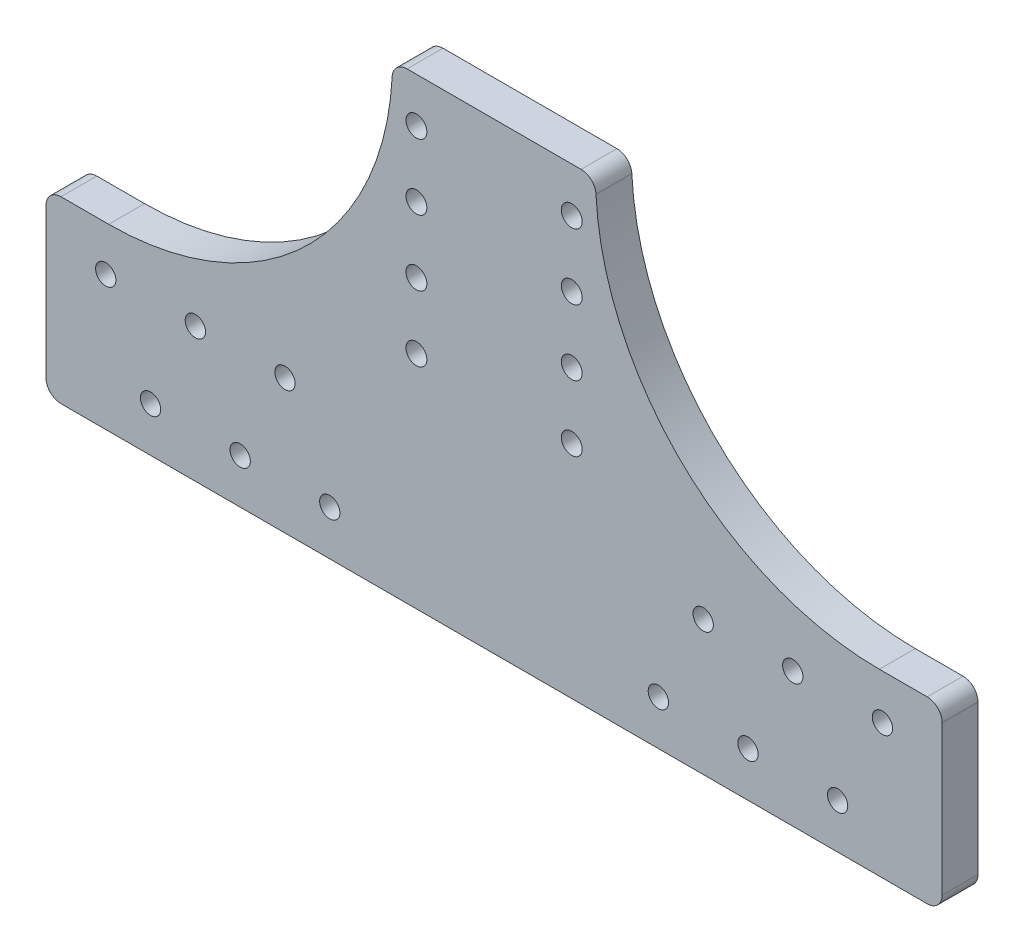
ISO-10303-21;
HEADER;
FILE_DESCRIPTION(('STEP AP214'),'2;1');
FILE_NAME('part.step','',(''),(''),'','','');
FILE_SCHEMA(('AUTOMOTIVE_DESIGN { 1 0 10303 214 1 1 1 1 }'));
ENDSEC;
DATA;
#1=APPLICATION_CONTEXT('core data for automotive mechanical design processes');
#2=APPLICATION_PROTOCOL_DEFINITION('international standard','automotive_design',2000,#1);
#3=PRODUCT_CONTEXT('',#1,'mechanical');
#4=PRODUCT('Part','Part','',(#3));
#5=PRODUCT_RELATED_PRODUCT_CATEGORY('part','',(#4));
#6=PRODUCT_DEFINITION_FORMATION('','',#4);
#7=PRODUCT_DEFINITION_CONTEXT('part definition',#1,'design');
#8=PRODUCT_DEFINITION('design','',#6,#7);
#9=PRODUCT_DEFINITION_SHAPE('','',#8);
#10=(LENGTH_UNIT() NAMED_UNIT(*) SI_UNIT(.MILLI.,.METRE.));
#11=(NAMED_UNIT(*) PLANE_ANGLE_UNIT() SI_UNIT($,.RADIAN.));
#12=(NAMED_UNIT(*) SI_UNIT($,.STERADIAN.) SOLID_ANGLE_UNIT());
#13=UNCERTAINTY_MEASURE_WITH_UNIT(LENGTH_MEASURE(1.E-05),#10,'distance_accuracy_value','');
#14=(GEOMETRIC_REPRESENTATION_CONTEXT(3) GLOBAL_UNCERTAINTY_ASSIGNED_CONTEXT((#13)) GLOBAL_UNIT_ASSIGNED_CONTEXT((#10,
#11,#12)) REPRESENTATION_CONTEXT('',''));
#15=CARTESIAN_POINT('',(0.,0.,0.));
#16=DIRECTION('',(0.,0.,1.));
#17=DIRECTION('',(1.,0.,0.));
#18=AXIS2_PLACEMENT_3D('',#15,#16,#17);
#19=CARTESIAN_POINT('',(26.,44.,6.));
#20=DIRECTION('',(0.,0.,1.));
#21=DIRECTION('',(1.,0.,0.));
#22=AXIS2_PLACEMENT_3D('',#19,#20,#21);
#23=CYLINDRICAL_SURFACE('',#22,3.5);
#24=CARTESIAN_POINT('',(26.,44.,-6.));
#25=DIRECTION('',(0.,0.,1.));
#26=DIRECTION('',(1.,0.,0.));
#27=AXIS2_PLACEMENT_3D('',#24,#25,#26);
#28=CIRCLE('',#27,3.5);
#29=CARTESIAN_POINT('',(29.5,44.,-6.));
#30=VERTEX_POINT('',#29);
#31=EDGE_CURVE('E210',#30,#30,#28,.T.);
#32=ORIENTED_EDGE('',*,*,#31,.F.);
#33=EDGE_LOOP('',(#32));
#34=FACE_BOUND('',#33,.T.);
#35=CARTESIAN_POINT('',(26.,44.,6.));
#36=DIRECTION('',(0.,0.,1.));
#37=DIRECTION('',(1.,0.,0.));
#38=AXIS2_PLACEMENT_3D('',#35,#36,#37);
#39=CIRCLE('',#38,3.5);
#40=CARTESIAN_POINT('',(29.5,44.,6.));
#41=VERTEX_POINT('',#40);
#42=EDGE_CURVE('E213',#41,#41,#39,.T.);
#43=ORIENTED_EDGE('',*,*,#42,.T.);
#44=EDGE_LOOP('',(#43));
#45=FACE_BOUND('',#44,.T.);
#46=ADVANCED_FACE('F33',(#34,#45),#23,.F.);
#47=CARTESIAN_POINT('',(26.,66.,6.));
#48=DIRECTION('',(0.,0.,1.));
#49=DIRECTION('',(1.,0.,0.));
#50=AXIS2_PLACEMENT_3D('',#47,#48,#49);
#51=CYLINDRICAL_SURFACE('',#50,3.5);
#52=CARTESIAN_POINT('',(26.,66.,-6.));
#53=DIRECTION('',(0.,0.,1.));
#54=DIRECTION('',(1.,0.,0.));
#55=AXIS2_PLACEMENT_3D('',#52,#53,#54);
#56=CIRCLE('',#55,3.5);
#57=CARTESIAN_POINT('',(29.5,66.,-6.));
#58=VERTEX_POINT('',#57);
#59=EDGE_CURVE('E204',#58,#58,#56,.T.);
#60=ORIENTED_EDGE('',*,*,#59,.F.);
#61=EDGE_LOOP('',(#60));
#62=FACE_BOUND('',#61,.T.);
#63=CARTESIAN_POINT('',(26.,66.,6.));
#64=DIRECTION('',(0.,0.,1.));
#65=DIRECTION('',(1.,0.,0.));
#66=AXIS2_PLACEMENT_3D('',#63,#64,#65);
#67=CIRCLE('',#66,3.5);
#68=CARTESIAN_POINT('',(29.5,66.,6.));
#69=VERTEX_POINT('',#68);
#70=EDGE_CURVE('E207',#69,#69,#67,.T.);
#71=ORIENTED_EDGE('',*,*,#70,.T.);
#72=EDGE_LOOP('',(#71));
#73=FACE_BOUND('',#72,.T.);
#74=ADVANCED_FACE('F325',(#62,#73),#51,.F.);
#75=CARTESIAN_POINT('',(150.,30.,6.));
#76=DIRECTION('',(-1.,0.,0.));
#77=DIRECTION('',(0.,0.,1.));
#78=AXIS2_PLACEMENT_3D('',#75,#76,#77);
#79=PLANE('',#78);
#80=DIRECTION('',(0.,1.,0.));
#81=VECTOR('',#80,1.);
#82=CARTESIAN_POINT('',(150.,30.,6.));
#83=LINE('',#82,#81);
#84=CARTESIAN_POINT('',(150.,-25.,6.));
#85=VERTEX_POINT('',#84);
#86=CARTESIAN_POINT('',(150.,25.,6.));
#87=VERTEX_POINT('',#86);
#88=EDGE_CURVE('E184',#85,#87,#83,.T.);
#89=ORIENTED_EDGE('',*,*,#88,.F.);
#90=DIRECTION('',(0.,0.,-1.));
#91=VECTOR('',#90,1.);
#92=CARTESIAN_POINT('',(150.,-25.,-6.));
#93=LINE('',#92,#91);
#94=CARTESIAN_POINT('',(150.,-25.,-6.));
#95=VERTEX_POINT('',#94);
#96=EDGE_CURVE('E236',#85,#95,#93,.T.);
#97=ORIENTED_EDGE('',*,*,#96,.T.);
#98=DIRECTION('',(0.,1.,0.));
#99=VECTOR('',#98,1.);
#100=CARTESIAN_POINT('',(150.,30.,-6.));
#101=LINE('',#100,#99);
#102=CARTESIAN_POINT('',(150.,25.,-6.));
#103=VERTEX_POINT('',#102);
#104=EDGE_CURVE('E183',#95,#103,#101,.T.);
#105=ORIENTED_EDGE('',*,*,#104,.T.);
#106=DIRECTION('',(0.,0.,-1.));
#107=VECTOR('',#106,1.);
#108=CARTESIAN_POINT('',(150.,25.,6.));
#109=LINE('',#108,#107);
#110=EDGE_CURVE('E224',#103,#87,#109,.F.);
#111=ORIENTED_EDGE('',*,*,#110,.T.);
#112=EDGE_LOOP('',(#89,#97,#105,#111));
#113=FACE_BOUND('',#112,.T.);
#114=ADVANCED_FACE('F292',(#113),#79,.F.);
#115=CARTESIAN_POINT('',(129.,30.,6.));
#116=DIRECTION('',(0.,-1.,0.));
#117=DIRECTION('',(0.,0.,-1.));
#118=AXIS2_PLACEMENT_3D('',#115,#116,#117);
#119=PLANE('',#118);
#120=DIRECTION('',(-1.,0.,0.));
#121=VECTOR('',#120,1.);
#122=CARTESIAN_POINT('',(129.,30.,6.));
#123=LINE('',#122,#121);
#124=CARTESIAN_POINT('',(145.,30.,6.));
#125=VERTEX_POINT('',#124);
#126=CARTESIAN_POINT('',(129.,30.,6.));
#127=VERTEX_POINT('',#126);
#128=EDGE_CURVE('E186',#125,#127,#123,.T.);
#129=ORIENTED_EDGE('',*,*,#128,.F.);
#130=DIRECTION('',(0.,0.,-1.));
#131=VECTOR('',#130,1.);
#132=CARTESIAN_POINT('',(145.,30.,6.));
#133=LINE('',#132,#131);
#134=CARTESIAN_POINT('',(145.,30.,-6.));
#135=VERTEX_POINT('',#134);
#136=EDGE_CURVE('E216',#125,#135,#133,.T.);
#137=ORIENTED_EDGE('',*,*,#136,.T.);
#138=DIRECTION('',(-1.,0.,0.));
#139=VECTOR('',#138,1.);
#140=CARTESIAN_POINT('',(129.,30.,-6.));
#141=LINE('',#140,#139);
#142=CARTESIAN_POINT('',(129.,30.,-6.));
#143=VERTEX_POINT('',#142);
#144=EDGE_CURVE('E196',#135,#143,#141,.T.);
#145=ORIENTED_EDGE('',*,*,#144,.T.);
#146=DIRECTION('',(0.,0.,-1.));
#147=VECTOR('',#146,1.);
#148=CARTESIAN_POINT('',(129.,30.,6.));
#149=LINE('',#148,#147);
#150=EDGE_CURVE('E194',#127,#143,#149,.T.);
#151=ORIENTED_EDGE('',*,*,#150,.F.);
#152=EDGE_LOOP('',(#129,#137,#145,#151));
#153=FACE_BOUND('',#152,.T.);
#154=ADVANCED_FACE('F304',(#153),#119,.F.);
#155=CARTESIAN_POINT('',(129.,125.,6.));
#156=DIRECTION('',(0.,0.,-1.));
#157=DIRECTION('',(-1.,0.,0.));
#158=AXIS2_PLACEMENT_3D('',#155,#156,#157);
#159=CYLINDRICAL_SURFACE('',#158,95.);
#160=CARTESIAN_POINT('',(129.,125.,-6.));
#161=DIRECTION('',(0.,0.,-1.));
#162=DIRECTION('',(1.,0.,0.));
#163=AXIS2_PLACEMENT_3D('',#160,#161,#162);
#164=CIRCLE('',#163,95.);
#165=CARTESIAN_POINT('',(34.1188243116686,120.25,-6.));
#166=VERTEX_POINT('',#165);
#167=EDGE_CURVE('E198',#143,#166,#164,.T.);
#168=ORIENTED_EDGE('',*,*,#167,.T.);
#169=DIRECTION('',(0.,0.,-1.));
#170=VECTOR('',#169,1.);
#171=CARTESIAN_POINT('',(34.1188243116686,120.25,6.));
#172=LINE('',#171,#170);
#173=CARTESIAN_POINT('',(34.1188243116686,120.25,6.));
#174=VERTEX_POINT('',#173);
#175=EDGE_CURVE('E234',#166,#174,#172,.F.);
#176=ORIENTED_EDGE('',*,*,#175,.T.);
#177=CARTESIAN_POINT('',(129.,125.,6.));
#178=DIRECTION('',(0.,0.,-1.));
#179=DIRECTION('',(1.,0.,0.));
#180=AXIS2_PLACEMENT_3D('',#177,#178,#179);
#181=CIRCLE('',#180,95.);
#182=EDGE_CURVE('E189',#127,#174,#181,.T.);
#183=ORIENTED_EDGE('',*,*,#182,.F.);
#184=ORIENTED_EDGE('',*,*,#150,.T.);
#185=EDGE_LOOP('',(#168,#176,#183,#184));
#186=FACE_BOUND('',#185,.T.);
#187=ADVANCED_FACE('F307',(#186),#159,.F.);
#188=CARTESIAN_POINT('',(0.,125.,6.));
#189=DIRECTION('',(0.,-1.,0.));
#190=DIRECTION('',(1.,0.,0.));
#191=AXIS2_PLACEMENT_3D('',#188,#189,#190);
#192=PLANE('',#191);
#193=DIRECTION('',(-1.,0.,0.));
#194=VECTOR('',#193,1.);
#195=CARTESIAN_POINT('',(0.,125.,-6.));
#196=LINE('',#195,#194);
#197=CARTESIAN_POINT('',(29.1250782228091,125.,-6.));
#198=VERTEX_POINT('',#197);
#199=CARTESIAN_POINT('',(-29.1250782228091,125.,-6.));
#200=VERTEX_POINT('',#199);
#201=EDGE_CURVE('E187',#198,#200,#196,.T.);
#202=ORIENTED_EDGE('',*,*,#201,.T.);
#203=DIRECTION('',(0.,0.,1.));
#204=VECTOR('',#203,1.);
#205=CARTESIAN_POINT('',(-29.1250782228091,125.,6.));
#206=LINE('',#205,#204);
#207=CARTESIAN_POINT('',(-29.1250782228091,125.,6.));
#208=VERTEX_POINT('',#207);
#209=EDGE_CURVE('E11',#200,#208,#206,.T.);
#210=ORIENTED_EDGE('',*,*,#209,.T.);
#211=DIRECTION('',(-1.,0.,0.));
#212=VECTOR('',#211,1.);
#213=CARTESIAN_POINT('',(0.,125.,6.));
#214=LINE('',#213,#212);
#215=CARTESIAN_POINT('',(29.1250782228091,125.,6.));
#216=VERTEX_POINT('',#215);
#217=EDGE_CURVE('E192',#216,#208,#214,.T.);
#218=ORIENTED_EDGE('',*,*,#217,.F.);
#219=DIRECTION('',(0.,0.,-1.));
#220=VECTOR('',#219,1.);
#221=CARTESIAN_POINT('',(29.1250782228091,125.,6.));
#222=LINE('',#221,#220);
#223=EDGE_CURVE('E231',#216,#198,#222,.T.);
#224=ORIENTED_EDGE('',*,*,#223,.T.);
#225=EDGE_LOOP('',(#202,#210,#218,#224));
#226=FACE_BOUND('',#225,.T.);
#227=ADVANCED_FACE('F313',(#226),#192,.F.);
#228=CARTESIAN_POINT('',(129.,125.,6.));
#229=DIRECTION('',(0.,0.,1.));
#230=DIRECTION('',(1.,0.,0.));
#231=AXIS2_PLACEMENT_3D('',#228,#229,#230);
#232=PLANE('',#231);
#233=CARTESIAN_POINT('',(-145.,-25.,6.));
#234=DIRECTION('',(0.,0.,1.));
#235=DIRECTION('',(1.,0.,0.));
#236=AXIS2_PLACEMENT_3D('',#233,#234,#235);
#237=CIRCLE('',#236,5.);
#238=CARTESIAN_POINT('',(-150.,-25.,6.));
#239=VERTEX_POINT('',#238);
#240=CARTESIAN_POINT('',(-145.,-30.,6.));
#241=VERTEX_POINT('',#240);
#242=EDGE_CURVE('E252',#239,#241,#237,.T.);
#243=ORIENTED_EDGE('',*,*,#242,.T.);
#244=DIRECTION('',(-1.,0.,0.));
#245=VECTOR('',#244,1.);
#246=CARTESIAN_POINT('',(129.,-30.,6.));
#247=LINE('',#246,#245);
#248=CARTESIAN_POINT('',(145.,-30.,6.));
#249=VERTEX_POINT('',#248);
#250=EDGE_CURVE('E170',#249,#241,#247,.T.);
#251=ORIENTED_EDGE('',*,*,#250,.F.);
#252=CARTESIAN_POINT('',(145.,-25.,6.));
#253=DIRECTION('',(0.,0.,1.));
#254=DIRECTION('',(1.,0.,0.));
#255=AXIS2_PLACEMENT_3D('',#252,#253,#254);
#256=CIRCLE('',#255,5.);
#257=EDGE_CURVE('E243',#249,#85,#256,.T.);
#258=ORIENTED_EDGE('',*,*,#257,.T.);
#259=ORIENTED_EDGE('',*,*,#88,.T.);
#260=CARTESIAN_POINT('',(145.,25.,6.));
#261=DIRECTION('',(0.,0.,1.));
#262=DIRECTION('',(1.,0.,0.));
#263=AXIS2_PLACEMENT_3D('',#260,#261,#262);
#264=CIRCLE('',#263,5.);
#265=EDGE_CURVE('E229',#87,#125,#264,.T.);
#266=ORIENTED_EDGE('',*,*,#265,.T.);
#267=ORIENTED_EDGE('',*,*,#128,.T.);
#268=ORIENTED_EDGE('',*,*,#182,.T.);
#269=CARTESIAN_POINT('',(29.1250782228091,120.,6.));
#270=DIRECTION('',(0.,0.,1.));
#271=DIRECTION('',(1.,0.,0.));
#272=AXIS2_PLACEMENT_3D('',#269,#270,#271);
#273=CIRCLE('',#272,5.);
#274=EDGE_CURVE('E227',#174,#216,#273,.T.);
#275=ORIENTED_EDGE('',*,*,#274,.T.);
#276=ORIENTED_EDGE('',*,*,#217,.T.);
#277=CARTESIAN_POINT('',(-29.1250782228091,120.,6.));
#278=DIRECTION('',(0.,0.,1.));
#279=DIRECTION('',(1.,0.,0.));
#280=AXIS2_PLACEMENT_3D('',#277,#278,#279);
#281=CIRCLE('',#280,5.);
#282=CARTESIAN_POINT('',(-34.1188243116686,120.25,6.));
#283=VERTEX_POINT('',#282);
#284=EDGE_CURVE('E48',#208,#283,#281,.T.);
#285=ORIENTED_EDGE('',*,*,#284,.T.);
#286=CARTESIAN_POINT('',(-129.,125.,6.));
#287=DIRECTION('',(0.,0.,1.));
#288=DIRECTION('',(-1.,0.,0.));
#289=AXIS2_PLACEMENT_3D('',#286,#287,#288);
#290=CIRCLE('',#289,95.);
#291=CARTESIAN_POINT('',(-129.,30.,6.));
#292=VERTEX_POINT('',#291);
#293=EDGE_CURVE('E145',#292,#283,#290,.T.);
#294=ORIENTED_EDGE('',*,*,#293,.F.);
#295=DIRECTION('',(1.,0.,0.));
#296=VECTOR('',#295,1.);
#297=CARTESIAN_POINT('',(-129.,30.,6.));
#298=LINE('',#297,#296);
#299=CARTESIAN_POINT('',(-145.,30.,6.));
#300=VERTEX_POINT('',#299);
#301=EDGE_CURVE('E135',#300,#292,#298,.T.);
#302=ORIENTED_EDGE('',*,*,#301,.F.);
#303=CARTESIAN_POINT('',(-145.,25.,6.));
#304=DIRECTION('',(0.,0.,1.));
#305=DIRECTION('',(1.,0.,0.));
#306=AXIS2_PLACEMENT_3D('',#303,#304,#305);
#307=CIRCLE('',#306,5.);
#308=CARTESIAN_POINT('',(-150.,25.,6.));
#309=VERTEX_POINT('',#308);
#310=EDGE_CURVE('E263',#300,#309,#307,.T.);
#311=ORIENTED_EDGE('',*,*,#310,.T.);
#312=DIRECTION('',(0.,1.,0.));
#313=VECTOR('',#312,1.);
#314=CARTESIAN_POINT('',(-150.,30.,6.));
#315=LINE('',#314,#313);
#316=EDGE_CURVE('E144',#239,#309,#315,.T.);
#317=ORIENTED_EDGE('',*,*,#316,.F.);
#318=EDGE_LOOP('',(#243,#251,#258,#259,#266,#267,#268,#275,#276,#285,#294,#302,#311,#317));
#319=FACE_BOUND('',#318,.T.);
#320=CARTESIAN_POINT('',(-130.,15.,6.));
#321=DIRECTION('',(0.,0.,1.));
#322=DIRECTION('',(1.,0.,0.));
#323=AXIS2_PLACEMENT_3D('',#320,#321,#322);
#324=CIRCLE('',#323,3.39999999999999);
#325=CARTESIAN_POINT('',(-126.6,15.,6.));
#326=VERTEX_POINT('',#325);
#327=EDGE_CURVE('E698',#326,#326,#324,.T.);
#328=ORIENTED_EDGE('',*,*,#327,.F.);
#329=EDGE_LOOP('',(#328));
#330=FACE_BOUND('',#329,.T.);
#331=CARTESIAN_POINT('',(-100.,15.,6.));
#332=DIRECTION('',(0.,0.,1.));
#333=DIRECTION('',(1.,0.,0.));
#334=AXIS2_PLACEMENT_3D('',#331,#332,#333);
#335=CIRCLE('',#334,3.4);
#336=CARTESIAN_POINT('',(-96.6,15.,6.));
#337=VERTEX_POINT('',#336);
#338=EDGE_CURVE('E700',#337,#337,#335,.T.);
#339=ORIENTED_EDGE('',*,*,#338,.F.);
#340=EDGE_LOOP('',(#339));
#341=FACE_BOUND('',#340,.T.);
#342=CARTESIAN_POINT('',(-70.,15.,6.));
#343=DIRECTION('',(0.,0.,1.));
#344=DIRECTION('',(1.,0.,0.));
#345=AXIS2_PLACEMENT_3D('',#342,#343,#344);
#346=CIRCLE('',#345,3.4);
#347=CARTESIAN_POINT('',(-66.6,15.,6.));
#348=VERTEX_POINT('',#347);
#349=EDGE_CURVE('E708',#348,#348,#346,.T.);
#350=ORIENTED_EDGE('',*,*,#349,.F.);
#351=EDGE_LOOP('',(#350));
#352=FACE_BOUND('',#351,.T.);
#353=CARTESIAN_POINT('',(-115.,-15.,6.));
#354=DIRECTION('',(0.,0.,1.));
#355=DIRECTION('',(1.,0.,0.));
#356=AXIS2_PLACEMENT_3D('',#353,#354,#355);
#357=CIRCLE('',#356,3.4);
#358=CARTESIAN_POINT('',(-111.6,-15.,6.));
#359=VERTEX_POINT('',#358);
#360=EDGE_CURVE('E714',#359,#359,#357,.T.);
#361=ORIENTED_EDGE('',*,*,#360,.F.);
#362=EDGE_LOOP('',(#361));
#363=FACE_BOUND('',#362,.T.);
#364=CARTESIAN_POINT('',(-85.,-15.,6.));
#365=DIRECTION('',(0.,0.,1.));
#366=DIRECTION('',(1.,0.,0.));
#367=AXIS2_PLACEMENT_3D('',#364,#365,#366);
#368=CIRCLE('',#367,3.4);
#369=CARTESIAN_POINT('',(-81.6,-15.,6.));
#370=VERTEX_POINT('',#369);
#371=EDGE_CURVE('E720',#370,#370,#368,.T.);
#372=ORIENTED_EDGE('',*,*,#371,.F.);
#373=EDGE_LOOP('',(#372));
#374=FACE_BOUND('',#373,.T.);
#375=CARTESIAN_POINT('',(-55.,-15.,6.));
#376=DIRECTION('',(0.,0.,1.));
#377=DIRECTION('',(1.,0.,0.));
#378=AXIS2_PLACEMENT_3D('',#375,#376,#377);
#379=CIRCLE('',#378,3.4);
#380=CARTESIAN_POINT('',(-51.6,-15.,6.));
#381=VERTEX_POINT('',#380);
#382=EDGE_CURVE('E726',#381,#381,#379,.T.);
#383=ORIENTED_EDGE('',*,*,#382,.F.);
#384=EDGE_LOOP('',(#383));
#385=FACE_BOUND('',#384,.T.);
#386=CARTESIAN_POINT('',(130.,15.,6.));
#387=DIRECTION('',(0.,0.,1.));
#388=DIRECTION('',(1.,0.,0.));
#389=AXIS2_PLACEMENT_3D('',#386,#387,#388);
#390=CIRCLE('',#389,3.39999999999999);
#391=CARTESIAN_POINT('',(133.4,15.,6.));
#392=VERTEX_POINT('',#391);
#393=EDGE_CURVE('E732',#392,#392,#390,.T.);
#394=ORIENTED_EDGE('',*,*,#393,.F.);
#395=EDGE_LOOP('',(#394));
#396=FACE_BOUND('',#395,.T.);
#397=CARTESIAN_POINT('',(100.,15.,6.));
#398=DIRECTION('',(0.,0.,1.));
#399=DIRECTION('',(1.,0.,0.));
#400=AXIS2_PLACEMENT_3D('',#397,#398,#399);
#401=CIRCLE('',#400,3.4);
#402=CARTESIAN_POINT('',(103.4,15.,6.));
#403=VERTEX_POINT('',#402);
#404=EDGE_CURVE('E738',#403,#403,#401,.T.);
#405=ORIENTED_EDGE('',*,*,#404,.F.);
#406=EDGE_LOOP('',(#405));
#407=FACE_BOUND('',#406,.T.);
#408=CARTESIAN_POINT('',(70.,15.,6.));
#409=DIRECTION('',(0.,0.,1.));
#410=DIRECTION('',(1.,0.,0.));
#411=AXIS2_PLACEMENT_3D('',#408,#409,#410);
#412=CIRCLE('',#411,3.4);
#413=CARTESIAN_POINT('',(73.4,15.,6.));
#414=VERTEX_POINT('',#413);
#415=EDGE_CURVE('E744',#414,#414,#412,.T.);
#416=ORIENTED_EDGE('',*,*,#415,.F.);
#417=EDGE_LOOP('',(#416));
#418=FACE_BOUND('',#417,.T.);
#419=CARTESIAN_POINT('',(115.,-15.,6.));
#420=DIRECTION('',(0.,0.,1.));
#421=DIRECTION('',(1.,0.,0.));
#422=AXIS2_PLACEMENT_3D('',#419,#420,#421);
#423=CIRCLE('',#422,3.4);
#424=CARTESIAN_POINT('',(118.4,-15.,6.));
#425=VERTEX_POINT('',#424);
#426=EDGE_CURVE('E750',#425,#425,#423,.T.);
#427=ORIENTED_EDGE('',*,*,#426,.F.);
#428=EDGE_LOOP('',(#427));
#429=FACE_BOUND('',#428,.T.);
#430=CARTESIAN_POINT('',(85.,-15.,6.));
#431=DIRECTION('',(0.,0.,1.));
#432=DIRECTION('',(1.,0.,0.));
#433=AXIS2_PLACEMENT_3D('',#430,#431,#432);
#434=CIRCLE('',#433,3.4);
#435=CARTESIAN_POINT('',(88.4,-15.,6.));
#436=VERTEX_POINT('',#435);
#437=EDGE_CURVE('E756',#436,#436,#434,.T.);
#438=ORIENTED_EDGE('',*,*,#437,.F.);
#439=EDGE_LOOP('',(#438));
#440=FACE_BOUND('',#439,.T.);
#441=CARTESIAN_POINT('',(55.,-15.,6.));
#442=DIRECTION('',(0.,0.,1.));
#443=DIRECTION('',(1.,0.,0.));
#444=AXIS2_PLACEMENT_3D('',#441,#442,#443);
#445=CIRCLE('',#444,3.4);
#446=CARTESIAN_POINT('',(58.4,-15.,6.));
#447=VERTEX_POINT('',#446);
#448=EDGE_CURVE('E762',#447,#447,#445,.T.);
#449=ORIENTED_EDGE('',*,*,#448,.F.);
#450=EDGE_LOOP('',(#449));
#451=FACE_BOUND('',#450,.T.);
#452=CARTESIAN_POINT('',(-26.,44.,6.));
#453=DIRECTION('',(0.,0.,1.));
#454=DIRECTION('',(1.,0.,0.));
#455=AXIS2_PLACEMENT_3D('',#452,#453,#454);
#456=CIRCLE('',#455,3.5);
#457=CARTESIAN_POINT('',(-22.5,44.,6.));
#458=VERTEX_POINT('',#457);
#459=EDGE_CURVE('E768',#458,#458,#456,.T.);
#460=ORIENTED_EDGE('',*,*,#459,.F.);
#461=EDGE_LOOP('',(#460));
#462=FACE_BOUND('',#461,.T.);
#463=CARTESIAN_POINT('',(-26.,66.,6.));
#464=DIRECTION('',(0.,0.,1.));
#465=DIRECTION('',(1.,0.,0.));
#466=AXIS2_PLACEMENT_3D('',#463,#464,#465);
#467=CIRCLE('',#466,3.5);
#468=CARTESIAN_POINT('',(-22.5,66.,6.));
#469=VERTEX_POINT('',#468);
#470=EDGE_CURVE('E774',#469,#469,#467,.T.);
#471=ORIENTED_EDGE('',*,*,#470,.F.);
#472=EDGE_LOOP('',(#471));
#473=FACE_BOUND('',#472,.T.);
#474=CARTESIAN_POINT('',(-26.,88.,6.));
#475=DIRECTION('',(0.,0.,1.));
#476=DIRECTION('',(1.,0.,0.));
#477=AXIS2_PLACEMENT_3D('',#474,#475,#476);
#478=CIRCLE('',#477,3.5);
#479=CARTESIAN_POINT('',(-22.5,88.,6.));
#480=VERTEX_POINT('',#479);
#481=EDGE_CURVE('E780',#480,#480,#478,.T.);
#482=ORIENTED_EDGE('',*,*,#481,.F.);
#483=EDGE_LOOP('',(#482));
#484=FACE_BOUND('',#483,.T.);
#485=CARTESIAN_POINT('',(-26.,110.,6.));
#486=DIRECTION('',(0.,0.,1.));
#487=DIRECTION('',(1.,0.,0.));
#488=AXIS2_PLACEMENT_3D('',#485,#486,#487);
#489=CIRCLE('',#488,3.5);
#490=CARTESIAN_POINT('',(-22.5,110.,6.));
#491=VERTEX_POINT('',#490);
#492=EDGE_CURVE('E786',#491,#491,#489,.T.);
#493=ORIENTED_EDGE('',*,*,#492,.F.);
#494=EDGE_LOOP('',(#493));
#495=FACE_BOUND('',#494,.T.);
#496=CARTESIAN_POINT('',(26.,88.,6.));
#497=DIRECTION('',(0.,0.,1.));
#498=DIRECTION('',(1.,0.,0.));
#499=AXIS2_PLACEMENT_3D('',#496,#497,#498);
#500=CIRCLE('',#499,3.5);
#501=CARTESIAN_POINT('',(29.5,88.,6.));
#502=VERTEX_POINT('',#501);
#503=EDGE_CURVE('E174',#502,#502,#500,.T.);
#504=ORIENTED_EDGE('',*,*,#503,.F.);
#505=EDGE_LOOP('',(#504));
#506=FACE_BOUND('',#505,.T.);
#507=CARTESIAN_POINT('',(26.,110.,6.));
#508=DIRECTION('',(0.,0.,1.));
#509=DIRECTION('',(1.,0.,0.));
#510=AXIS2_PLACEMENT_3D('',#507,#508,#509);
#511=CIRCLE('',#510,3.5);
#512=CARTESIAN_POINT('',(29.5,110.,6.));
#513=VERTEX_POINT('',#512);
#514=EDGE_CURVE('E177',#513,#513,#511,.T.);
#515=ORIENTED_EDGE('',*,*,#514,.F.);
#516=EDGE_LOOP('',(#515));
#517=FACE_BOUND('',#516,.T.);
#518=ORIENTED_EDGE('',*,*,#70,.F.);
#519=EDGE_LOOP('',(#518));
#520=FACE_BOUND('',#519,.T.);
#521=ORIENTED_EDGE('',*,*,#42,.F.);
#522=EDGE_LOOP('',(#521));
#523=FACE_BOUND('',#522,.T.);
#524=ADVANCED_FACE('F156',(#319,#330,#341,#352,#363,#374,#385,#396,#407,#418,#429,#440,#451,
#462,#473,#484,#495,#506,#517,#520,#523),#232,.T.);
#525=CARTESIAN_POINT('',(129.,125.,-6.));
#526=DIRECTION('',(0.,0.,1.));
#527=DIRECTION('',(1.,0.,0.));
#528=AXIS2_PLACEMENT_3D('',#525,#526,#527);
#529=PLANE('',#528);
#530=CARTESIAN_POINT('',(-130.,15.,-6.));
#531=DIRECTION('',(0.,0.,1.));
#532=DIRECTION('',(1.,0.,0.));
#533=AXIS2_PLACEMENT_3D('',#530,#531,#532);
#534=CIRCLE('',#533,3.39999999999999);
#535=CARTESIAN_POINT('',(-126.6,15.,-6.));
#536=VERTEX_POINT('',#535);
#537=EDGE_CURVE('E695',#536,#536,#534,.T.);
#538=ORIENTED_EDGE('',*,*,#537,.T.);
#539=EDGE_LOOP('',(#538));
#540=FACE_BOUND('',#539,.T.);
#541=CARTESIAN_POINT('',(-100.,15.,-6.));
#542=DIRECTION('',(0.,0.,1.));
#543=DIRECTION('',(1.,0.,0.));
#544=AXIS2_PLACEMENT_3D('',#541,#542,#543);
#545=CIRCLE('',#544,3.4);
#546=CARTESIAN_POINT('',(-96.6,15.,-6.));
#547=VERTEX_POINT('',#546);
#548=EDGE_CURVE('E705',#547,#547,#545,.T.);
#549=ORIENTED_EDGE('',*,*,#548,.T.);
#550=EDGE_LOOP('',(#549));
#551=FACE_BOUND('',#550,.T.);
#552=CARTESIAN_POINT('',(-70.,15.,-6.));
#553=DIRECTION('',(0.,0.,1.));
#554=DIRECTION('',(1.,0.,0.));
#555=AXIS2_PLACEMENT_3D('',#552,#553,#554);
#556=CIRCLE('',#555,3.4);
#557=CARTESIAN_POINT('',(-66.6,15.,-6.));
#558=VERTEX_POINT('',#557);
#559=EDGE_CURVE('E711',#558,#558,#556,.T.);
#560=ORIENTED_EDGE('',*,*,#559,.T.);
#561=EDGE_LOOP('',(#560));
#562=FACE_BOUND('',#561,.T.);
#563=CARTESIAN_POINT('',(-115.,-15.,-6.));
#564=DIRECTION('',(0.,0.,1.));
#565=DIRECTION('',(1.,0.,0.));
#566=AXIS2_PLACEMENT_3D('',#563,#564,#565);
#567=CIRCLE('',#566,3.4);
#568=CARTESIAN_POINT('',(-111.6,-15.,-6.));
#569=VERTEX_POINT('',#568);
#570=EDGE_CURVE('E717',#569,#569,#567,.T.);
#571=ORIENTED_EDGE('',*,*,#570,.T.);
#572=EDGE_LOOP('',(#571));
#573=FACE_BOUND('',#572,.T.);
#574=CARTESIAN_POINT('',(-85.,-15.,-6.));
#575=DIRECTION('',(0.,0.,1.));
#576=DIRECTION('',(1.,0.,0.));
#577=AXIS2_PLACEMENT_3D('',#574,#575,#576);
#578=CIRCLE('',#577,3.4);
#579=CARTESIAN_POINT('',(-81.6,-15.,-6.));
#580=VERTEX_POINT('',#579);
#581=EDGE_CURVE('E723',#580,#580,#578,.T.);
#582=ORIENTED_EDGE('',*,*,#581,.T.);
#583=EDGE_LOOP('',(#582));
#584=FACE_BOUND('',#583,.T.);
#585=CARTESIAN_POINT('',(-55.,-15.,-6.));
#586=DIRECTION('',(0.,0.,1.));
#587=DIRECTION('',(1.,0.,0.));
#588=AXIS2_PLACEMENT_3D('',#585,#586,#587);
#589=CIRCLE('',#588,3.4);
#590=CARTESIAN_POINT('',(-51.6,-15.,-6.));
#591=VERTEX_POINT('',#590);
#592=EDGE_CURVE('E729',#591,#591,#589,.T.);
#593=ORIENTED_EDGE('',*,*,#592,.T.);
#594=EDGE_LOOP('',(#593));
#595=FACE_BOUND('',#594,.T.);
#596=CARTESIAN_POINT('',(130.,15.,-6.));
#597=DIRECTION('',(0.,0.,1.));
#598=DIRECTION('',(1.,0.,0.));
#599=AXIS2_PLACEMENT_3D('',#596,#597,#598);
#600=CIRCLE('',#599,3.39999999999999);
#601=CARTESIAN_POINT('',(133.4,15.,-6.));
#602=VERTEX_POINT('',#601);
#603=EDGE_CURVE('E735',#602,#602,#600,.T.);
#604=ORIENTED_EDGE('',*,*,#603,.T.);
#605=EDGE_LOOP('',(#604));
#606=FACE_BOUND('',#605,.T.);
#607=CARTESIAN_POINT('',(100.,15.,-6.));
#608=DIRECTION('',(0.,0.,1.));
#609=DIRECTION('',(1.,0.,0.));
#610=AXIS2_PLACEMENT_3D('',#607,#608,#609);
#611=CIRCLE('',#610,3.4);
#612=CARTESIAN_POINT('',(103.4,15.,-6.));
#613=VERTEX_POINT('',#612);
#614=EDGE_CURVE('E741',#613,#613,#611,.T.);
#615=ORIENTED_EDGE('',*,*,#614,.T.);
#616=EDGE_LOOP('',(#615));
#617=FACE_BOUND('',#616,.T.);
#618=CARTESIAN_POINT('',(70.,15.,-6.));
#619=DIRECTION('',(0.,0.,1.));
#620=DIRECTION('',(1.,0.,0.));
#621=AXIS2_PLACEMENT_3D('',#618,#619,#620);
#622=CIRCLE('',#621,3.4);
#623=CARTESIAN_POINT('',(73.4,15.,-6.));
#624=VERTEX_POINT('',#623);
#625=EDGE_CURVE('E747',#624,#624,#622,.T.);
#626=ORIENTED_EDGE('',*,*,#625,.T.);
#627=EDGE_LOOP('',(#626));
#628=FACE_BOUND('',#627,.T.);
#629=CARTESIAN_POINT('',(115.,-15.,-6.));
#630=DIRECTION('',(0.,0.,1.));
#631=DIRECTION('',(1.,0.,0.));
#632=AXIS2_PLACEMENT_3D('',#629,#630,#631);
#633=CIRCLE('',#632,3.4);
#634=CARTESIAN_POINT('',(118.4,-15.,-6.));
#635=VERTEX_POINT('',#634);
#636=EDGE_CURVE('E753',#635,#635,#633,.T.);
#637=ORIENTED_EDGE('',*,*,#636,.T.);
#638=EDGE_LOOP('',(#637));
#639=FACE_BOUND('',#638,.T.);
#640=CARTESIAN_POINT('',(85.,-15.,-6.));
#641=DIRECTION('',(0.,0.,1.));
#642=DIRECTION('',(1.,0.,0.));
#643=AXIS2_PLACEMENT_3D('',#640,#641,#642);
#644=CIRCLE('',#643,3.4);
#645=CARTESIAN_POINT('',(88.4,-15.,-6.));
#646=VERTEX_POINT('',#645);
#647=EDGE_CURVE('E759',#646,#646,#644,.T.);
#648=ORIENTED_EDGE('',*,*,#647,.T.);
#649=EDGE_LOOP('',(#648));
#650=FACE_BOUND('',#649,.T.);
#651=CARTESIAN_POINT('',(55.,-15.,-6.));
#652=DIRECTION('',(0.,0.,1.));
#653=DIRECTION('',(1.,0.,0.));
#654=AXIS2_PLACEMENT_3D('',#651,#652,#653);
#655=CIRCLE('',#654,3.4);
#656=CARTESIAN_POINT('',(58.4,-15.,-6.));
#657=VERTEX_POINT('',#656);
#658=EDGE_CURVE('E765',#657,#657,#655,.T.);
#659=ORIENTED_EDGE('',*,*,#658,.T.);
#660=EDGE_LOOP('',(#659));
#661=FACE_BOUND('',#660,.T.);
#662=CARTESIAN_POINT('',(-26.,44.,-6.));
#663=DIRECTION('',(0.,0.,1.));
#664=DIRECTION('',(1.,0.,0.));
#665=AXIS2_PLACEMENT_3D('',#662,#663,#664);
#666=CIRCLE('',#665,3.5);
#667=CARTESIAN_POINT('',(-22.5,44.,-6.));
#668=VERTEX_POINT('',#667);
#669=EDGE_CURVE('E771',#668,#668,#666,.T.);
#670=ORIENTED_EDGE('',*,*,#669,.T.);
#671=EDGE_LOOP('',(#670));
#672=FACE_BOUND('',#671,.T.);
#673=CARTESIAN_POINT('',(-26.,66.,-6.));
#674=DIRECTION('',(0.,0.,1.));
#675=DIRECTION('',(1.,0.,0.));
#676=AXIS2_PLACEMENT_3D('',#673,#674,#675);
#677=CIRCLE('',#676,3.5);
#678=CARTESIAN_POINT('',(-22.5,66.,-6.));
#679=VERTEX_POINT('',#678);
#680=EDGE_CURVE('E777',#679,#679,#677,.T.);
#681=ORIENTED_EDGE('',*,*,#680,.T.);
#682=EDGE_LOOP('',(#681));
#683=FACE_BOUND('',#682,.T.);
#684=CARTESIAN_POINT('',(-26.,88.,-6.));
#685=DIRECTION('',(0.,0.,1.));
#686=DIRECTION('',(1.,0.,0.));
#687=AXIS2_PLACEMENT_3D('',#684,#685,#686);
#688=CIRCLE('',#687,3.5);
#689=CARTESIAN_POINT('',(-22.5,88.,-6.));
#690=VERTEX_POINT('',#689);
#691=EDGE_CURVE('E783',#690,#690,#688,.T.);
#692=ORIENTED_EDGE('',*,*,#691,.T.);
#693=EDGE_LOOP('',(#692));
#694=FACE_BOUND('',#693,.T.);
#695=CARTESIAN_POINT('',(-26.,110.,-6.));
#696=DIRECTION('',(0.,0.,1.));
#697=DIRECTION('',(1.,0.,0.));
#698=AXIS2_PLACEMENT_3D('',#695,#696,#697);
#699=CIRCLE('',#698,3.5);
#700=CARTESIAN_POINT('',(-22.5,110.,-6.));
#701=VERTEX_POINT('',#700);
#702=EDGE_CURVE('E789',#701,#701,#699,.T.);
#703=ORIENTED_EDGE('',*,*,#702,.T.);
#704=EDGE_LOOP('',(#703));
#705=FACE_BOUND('',#704,.T.);
#706=DIRECTION('',(-1.,0.,0.));
#707=VECTOR('',#706,1.);
#708=CARTESIAN_POINT('',(129.,-30.,-6.));
#709=LINE('',#708,#707);
#710=CARTESIAN_POINT('',(145.,-30.,-6.));
#711=VERTEX_POINT('',#710);
#712=CARTESIAN_POINT('',(-145.,-30.,-6.));
#713=VERTEX_POINT('',#712);
#714=EDGE_CURVE('E164',#711,#713,#709,.T.);
#715=ORIENTED_EDGE('',*,*,#714,.T.);
#716=CARTESIAN_POINT('',(-145.,-25.,-6.));
#717=DIRECTION('',(0.,0.,1.));
#718=DIRECTION('',(1.,0.,0.));
#719=AXIS2_PLACEMENT_3D('',#716,#717,#718);
#720=CIRCLE('',#719,5.);
#721=CARTESIAN_POINT('',(-150.,-25.,-6.));
#722=VERTEX_POINT('',#721);
#723=EDGE_CURVE('E248',#713,#722,#720,.F.);
#724=ORIENTED_EDGE('',*,*,#723,.T.);
#725=DIRECTION('',(0.,1.,0.));
#726=VECTOR('',#725,1.);
#727=CARTESIAN_POINT('',(-150.,30.,-6.));
#728=LINE('',#727,#726);
#729=CARTESIAN_POINT('',(-150.,25.,-6.));
#730=VERTEX_POINT('',#729);
#731=EDGE_CURVE('E158',#722,#730,#728,.T.);
#732=ORIENTED_EDGE('',*,*,#731,.T.);
#733=CARTESIAN_POINT('',(-145.,25.,-6.));
#734=DIRECTION('',(0.,0.,1.));
#735=DIRECTION('',(1.,0.,0.));
#736=AXIS2_PLACEMENT_3D('',#733,#734,#735);
#737=CIRCLE('',#736,5.);
#738=CARTESIAN_POINT('',(-145.,30.,-6.));
#739=VERTEX_POINT('',#738);
#740=EDGE_CURVE('E259',#730,#739,#737,.F.);
#741=ORIENTED_EDGE('',*,*,#740,.T.);
#742=DIRECTION('',(1.,0.,0.));
#743=VECTOR('',#742,1.);
#744=CARTESIAN_POINT('',(-129.,30.,-6.));
#745=LINE('',#744,#743);
#746=CARTESIAN_POINT('',(-129.,30.,-6.));
#747=VERTEX_POINT('',#746);
#748=EDGE_CURVE('E161',#739,#747,#745,.T.);
#749=ORIENTED_EDGE('',*,*,#748,.T.);
#750=CARTESIAN_POINT('',(-129.,125.,-6.));
#751=DIRECTION('',(0.,0.,1.));
#752=DIRECTION('',(-1.,0.,0.));
#753=AXIS2_PLACEMENT_3D('',#750,#751,#752);
#754=CIRCLE('',#753,95.);
#755=CARTESIAN_POINT('',(-34.1188243116686,120.25,-6.));
#756=VERTEX_POINT('',#755);
#757=EDGE_CURVE('E152',#747,#756,#754,.T.);
#758=ORIENTED_EDGE('',*,*,#757,.T.);
#759=CARTESIAN_POINT('',(-29.1250782228091,120.,-6.));
#760=DIRECTION('',(0.,0.,1.));
#761=DIRECTION('',(1.,0.,0.));
#762=AXIS2_PLACEMENT_3D('',#759,#760,#761);
#763=CIRCLE('',#762,5.);
#764=EDGE_CURVE('E257',#756,#200,#763,.F.);
#765=ORIENTED_EDGE('',*,*,#764,.T.);
#766=ORIENTED_EDGE('',*,*,#201,.F.);
#767=CARTESIAN_POINT('',(29.1250782228091,120.,-6.));
#768=DIRECTION('',(0.,0.,1.));
#769=DIRECTION('',(1.,0.,0.));
#770=AXIS2_PLACEMENT_3D('',#767,#768,#769);
#771=CIRCLE('',#770,5.);
#772=EDGE_CURVE('E219',#198,#166,#771,.F.);
#773=ORIENTED_EDGE('',*,*,#772,.T.);
#774=ORIENTED_EDGE('',*,*,#167,.F.);
#775=ORIENTED_EDGE('',*,*,#144,.F.);
#776=CARTESIAN_POINT('',(145.,25.,-6.));
#777=DIRECTION('',(0.,0.,1.));
#778=DIRECTION('',(1.,0.,0.));
#779=AXIS2_PLACEMENT_3D('',#776,#777,#778);
#780=CIRCLE('',#779,5.);
#781=EDGE_CURVE('E221',#135,#103,#780,.F.);
#782=ORIENTED_EDGE('',*,*,#781,.T.);
#783=ORIENTED_EDGE('',*,*,#104,.F.);
#784=CARTESIAN_POINT('',(145.,-25.,-6.));
#785=DIRECTION('',(0.,0.,1.));
#786=DIRECTION('',(1.,0.,0.));
#787=AXIS2_PLACEMENT_3D('',#784,#785,#786);
#788=CIRCLE('',#787,5.);
#789=EDGE_CURVE('E239',#95,#711,#788,.F.);
#790=ORIENTED_EDGE('',*,*,#789,.T.);
#791=EDGE_LOOP('',(#715,#724,#732,#741,#749,#758,#765,#766,#773,#774,#775,#782,#783,#790));
#792=FACE_BOUND('',#791,.T.);
#793=CARTESIAN_POINT('',(26.,88.,-6.));
#794=DIRECTION('',(0.,0.,1.));
#795=DIRECTION('',(1.,0.,0.));
#796=AXIS2_PLACEMENT_3D('',#793,#794,#795);
#797=CIRCLE('',#796,3.5);
#798=CARTESIAN_POINT('',(29.5,88.,-6.));
#799=VERTEX_POINT('',#798);
#800=EDGE_CURVE('E153',#799,#799,#797,.T.);
#801=ORIENTED_EDGE('',*,*,#800,.T.);
#802=EDGE_LOOP('',(#801));
#803=FACE_BOUND('',#802,.T.);
#804=CARTESIAN_POINT('',(26.,110.,-6.));
#805=DIRECTION('',(0.,0.,1.));
#806=DIRECTION('',(1.,0.,0.));
#807=AXIS2_PLACEMENT_3D('',#804,#805,#806);
#808=CIRCLE('',#807,3.5);
#809=CARTESIAN_POINT('',(29.5,110.,-6.));
#810=VERTEX_POINT('',#809);
#811=EDGE_CURVE('E180',#810,#810,#808,.T.);
#812=ORIENTED_EDGE('',*,*,#811,.T.);
#813=EDGE_LOOP('',(#812));
#814=FACE_BOUND('',#813,.T.);
#815=ORIENTED_EDGE('',*,*,#59,.T.);
#816=EDGE_LOOP('',(#815));
#817=FACE_BOUND('',#816,.T.);
#818=ORIENTED_EDGE('',*,*,#31,.T.);
#819=EDGE_LOOP('',(#818));
#820=FACE_BOUND('',#819,.T.);
#821=ADVANCED_FACE('F266',(#540,#551,#562,#573,#584,#595,#606,#617,#628,#639,#650,#661,#672,
#683,#694,#705,#792,#803,#814,#817,#820),#529,.F.);
#822=CARTESIAN_POINT('',(26.,110.,6.));
#823=DIRECTION('',(0.,0.,1.));
#824=DIRECTION('',(1.,0.,0.));
#825=AXIS2_PLACEMENT_3D('',#822,#823,#824);
#826=CYLINDRICAL_SURFACE('',#825,3.5);
#827=ORIENTED_EDGE('',*,*,#811,.F.);
#828=EDGE_LOOP('',(#827));
#829=FACE_BOUND('',#828,.T.);
#830=ORIENTED_EDGE('',*,*,#514,.T.);
#831=EDGE_LOOP('',(#830));
#832=FACE_BOUND('',#831,.T.);
#833=ADVANCED_FACE('F373',(#829,#832),#826,.F.);
#834=CARTESIAN_POINT('',(26.,88.,6.));
#835=DIRECTION('',(0.,0.,1.));
#836=DIRECTION('',(1.,0.,0.));
#837=AXIS2_PLACEMENT_3D('',#834,#835,#836);
#838=CYLINDRICAL_SURFACE('',#837,3.5);
#839=ORIENTED_EDGE('',*,*,#800,.F.);
#840=EDGE_LOOP('',(#839));
#841=FACE_BOUND('',#840,.T.);
#842=ORIENTED_EDGE('',*,*,#503,.T.);
#843=EDGE_LOOP('',(#842));
#844=FACE_BOUND('',#843,.T.);
#845=ADVANCED_FACE('F339',(#841,#844),#838,.F.);
#846=CARTESIAN_POINT('',(145.,25.,6.));
#847=DIRECTION('',(0.,0.,-1.));
#848=DIRECTION('',(-1.,0.,0.));
#849=AXIS2_PLACEMENT_3D('',#846,#847,#848);
#850=CYLINDRICAL_SURFACE('',#849,5.);
#851=ORIENTED_EDGE('',*,*,#265,.F.);
#852=ORIENTED_EDGE('',*,*,#110,.F.);
#853=ORIENTED_EDGE('',*,*,#781,.F.);
#854=ORIENTED_EDGE('',*,*,#136,.F.);
#855=EDGE_LOOP('',(#851,#852,#853,#854));
#856=FACE_BOUND('',#855,.T.);
#857=ADVANCED_FACE('F300',(#856),#850,.T.);
#858=CARTESIAN_POINT('',(29.1250782228091,120.,6.));
#859=DIRECTION('',(0.,0.,-1.));
#860=DIRECTION('',(-1.,0.,0.));
#861=AXIS2_PLACEMENT_3D('',#858,#859,#860);
#862=CYLINDRICAL_SURFACE('',#861,5.);
#863=ORIENTED_EDGE('',*,*,#274,.F.);
#864=ORIENTED_EDGE('',*,*,#175,.F.);
#865=ORIENTED_EDGE('',*,*,#772,.F.);
#866=ORIENTED_EDGE('',*,*,#223,.F.);
#867=EDGE_LOOP('',(#863,#864,#865,#866));
#868=FACE_BOUND('',#867,.T.);
#869=ADVANCED_FACE('F312',(#868),#862,.T.);
#870=CARTESIAN_POINT('',(-129.,125.,6.));
#871=DIRECTION('',(0.,0.,-1.));
#872=DIRECTION('',(-1.,0.,0.));
#873=AXIS2_PLACEMENT_3D('',#870,#871,#872);
#874=CYLINDRICAL_SURFACE('',#873,95.);
#875=ORIENTED_EDGE('',*,*,#293,.T.);
#876=DIRECTION('',(0.,0.,-1.));
#877=VECTOR('',#876,1.);
#878=CARTESIAN_POINT('',(-34.1188243116686,120.25,6.));
#879=LINE('',#878,#877);
#880=EDGE_CURVE('E41',#283,#756,#879,.T.);
#881=ORIENTED_EDGE('',*,*,#880,.T.);
#882=ORIENTED_EDGE('',*,*,#757,.F.);
#883=DIRECTION('',(0.,0.,-1.));
#884=VECTOR('',#883,1.);
#885=CARTESIAN_POINT('',(-129.,30.,6.));
#886=LINE('',#885,#884);
#887=EDGE_CURVE('E139',#292,#747,#886,.T.);
#888=ORIENTED_EDGE('',*,*,#887,.F.);
#889=EDGE_LOOP('',(#875,#881,#882,#888));
#890=FACE_BOUND('',#889,.T.);
#891=ADVANCED_FACE('F148',(#890),#874,.F.);
#892=CARTESIAN_POINT('',(-129.,30.,6.));
#893=DIRECTION('',(0.,1.,0.));
#894=DIRECTION('',(0.,0.,1.));
#895=AXIS2_PLACEMENT_3D('',#892,#893,#894);
#896=PLANE('',#895);
#897=ORIENTED_EDGE('',*,*,#748,.F.);
#898=DIRECTION('',(0.,0.,-1.));
#899=VECTOR('',#898,1.);
#900=CARTESIAN_POINT('',(-145.,30.,6.));
#901=LINE('',#900,#899);
#902=EDGE_CURVE('E142',#739,#300,#901,.F.);
#903=ORIENTED_EDGE('',*,*,#902,.T.);
#904=ORIENTED_EDGE('',*,*,#301,.T.);
#905=ORIENTED_EDGE('',*,*,#887,.T.);
#906=EDGE_LOOP('',(#897,#903,#904,#905));
#907=FACE_BOUND('',#906,.T.);
#908=ADVANCED_FACE('F138',(#907),#896,.T.);
#909=CARTESIAN_POINT('',(-150.,30.,6.));
#910=DIRECTION('',(-1.,0.,0.));
#911=DIRECTION('',(0.,0.,1.));
#912=AXIS2_PLACEMENT_3D('',#909,#910,#911);
#913=PLANE('',#912);
#914=ORIENTED_EDGE('',*,*,#316,.T.);
#915=DIRECTION('',(0.,0.,-1.));
#916=VECTOR('',#915,1.);
#917=CARTESIAN_POINT('',(-150.,25.,6.));
#918=LINE('',#917,#916);
#919=EDGE_CURVE('E254',#309,#730,#918,.T.);
#920=ORIENTED_EDGE('',*,*,#919,.T.);
#921=ORIENTED_EDGE('',*,*,#731,.F.);
#922=DIRECTION('',(0.,0.,-1.));
#923=VECTOR('',#922,1.);
#924=CARTESIAN_POINT('',(-150.,-25.,6.));
#925=LINE('',#924,#923);
#926=EDGE_CURVE('E250',#722,#239,#925,.F.);
#927=ORIENTED_EDGE('',*,*,#926,.T.);
#928=EDGE_LOOP('',(#914,#920,#921,#927));
#929=FACE_BOUND('',#928,.T.);
#930=ADVANCED_FACE('F275',(#929),#913,.T.);
#931=CARTESIAN_POINT('',(129.,-30.,6.));
#932=DIRECTION('',(0.,-1.,0.));
#933=DIRECTION('',(0.,0.,-1.));
#934=AXIS2_PLACEMENT_3D('',#931,#932,#933);
#935=PLANE('',#934);
#936=ORIENTED_EDGE('',*,*,#714,.F.);
#937=DIRECTION('',(0.,0.,-1.));
#938=VECTOR('',#937,1.);
#939=CARTESIAN_POINT('',(145.,-30.,6.));
#940=LINE('',#939,#938);
#941=EDGE_CURVE('E241',#711,#249,#940,.F.);
#942=ORIENTED_EDGE('',*,*,#941,.T.);
#943=ORIENTED_EDGE('',*,*,#250,.T.);
#944=DIRECTION('',(0.,0.,-1.));
#945=VECTOR('',#944,1.);
#946=CARTESIAN_POINT('',(-145.,-30.,-6.));
#947=LINE('',#946,#945);
#948=EDGE_CURVE('E245',#241,#713,#947,.T.);
#949=ORIENTED_EDGE('',*,*,#948,.T.);
#950=EDGE_LOOP('',(#936,#942,#943,#949));
#951=FACE_BOUND('',#950,.T.);
#952=ADVANCED_FACE('F344',(#951),#935,.T.);
#953=CARTESIAN_POINT('',(145.,-25.,6.));
#954=DIRECTION('',(0.,0.,1.));
#955=DIRECTION('',(1.,0.,0.));
#956=AXIS2_PLACEMENT_3D('',#953,#954,#955);
#957=CYLINDRICAL_SURFACE('',#956,5.);
#958=ORIENTED_EDGE('',*,*,#257,.F.);
#959=ORIENTED_EDGE('',*,*,#941,.F.);
#960=ORIENTED_EDGE('',*,*,#789,.F.);
#961=ORIENTED_EDGE('',*,*,#96,.F.);
#962=EDGE_LOOP('',(#958,#959,#960,#961));
#963=FACE_BOUND('',#962,.T.);
#964=ADVANCED_FACE('F289',(#963),#957,.T.);
#965=CARTESIAN_POINT('',(-145.,-25.,6.));
#966=DIRECTION('',(0.,0.,1.));
#967=DIRECTION('',(1.,0.,0.));
#968=AXIS2_PLACEMENT_3D('',#965,#966,#967);
#969=CYLINDRICAL_SURFACE('',#968,5.);
#970=ORIENTED_EDGE('',*,*,#242,.F.);
#971=ORIENTED_EDGE('',*,*,#926,.F.);
#972=ORIENTED_EDGE('',*,*,#723,.F.);
#973=ORIENTED_EDGE('',*,*,#948,.F.);
#974=EDGE_LOOP('',(#970,#971,#972,#973));
#975=FACE_BOUND('',#974,.T.);
#976=ADVANCED_FACE('F280',(#975),#969,.T.);
#977=CARTESIAN_POINT('',(-26.,110.,6.));
#978=DIRECTION('',(0.,0.,1.));
#979=DIRECTION('',(1.,0.,0.));
#980=AXIS2_PLACEMENT_3D('',#977,#978,#979);
#981=CYLINDRICAL_SURFACE('',#980,3.5);
#982=ORIENTED_EDGE('',*,*,#702,.F.);
#983=EDGE_LOOP('',(#982));
#984=FACE_BOUND('',#983,.T.);
#985=ORIENTED_EDGE('',*,*,#492,.T.);
#986=EDGE_LOOP('',(#985));
#987=FACE_BOUND('',#986,.T.);
#988=ADVANCED_FACE('F346',(#984,#987),#981,.F.);
#989=CARTESIAN_POINT('',(-26.,88.,6.));
#990=DIRECTION('',(0.,0.,1.));
#991=DIRECTION('',(1.,0.,0.));
#992=AXIS2_PLACEMENT_3D('',#989,#990,#991);
#993=CYLINDRICAL_SURFACE('',#992,3.5);
#994=ORIENTED_EDGE('',*,*,#691,.F.);
#995=EDGE_LOOP('',(#994));
#996=FACE_BOUND('',#995,.T.);
#997=ORIENTED_EDGE('',*,*,#481,.T.);
#998=EDGE_LOOP('',(#997));
#999=FACE_BOUND('',#998,.T.);
#1000=ADVANCED_FACE('F350',(#996,#999),#993,.F.);
#1001=CARTESIAN_POINT('',(-26.,66.,6.));
#1002=DIRECTION('',(0.,0.,1.));
#1003=DIRECTION('',(1.,0.,0.));
#1004=AXIS2_PLACEMENT_3D('',#1001,#1002,#1003);
#1005=CYLINDRICAL_SURFACE('',#1004,3.5);
#1006=ORIENTED_EDGE('',*,*,#680,.F.);
#1007=EDGE_LOOP('',(#1006));
#1008=FACE_BOUND('',#1007,.T.);
#1009=ORIENTED_EDGE('',*,*,#470,.T.);
#1010=EDGE_LOOP('',(#1009));
#1011=FACE_BOUND('',#1010,.T.);
#1012=ADVANCED_FACE('F356',(#1008,#1011),#1005,.F.);
#1013=CARTESIAN_POINT('',(-26.,44.,6.));
#1014=DIRECTION('',(0.,0.,1.));
#1015=DIRECTION('',(1.,0.,0.));
#1016=AXIS2_PLACEMENT_3D('',#1013,#1014,#1015);
#1017=CYLINDRICAL_SURFACE('',#1016,3.5);
#1018=ORIENTED_EDGE('',*,*,#669,.F.);
#1019=EDGE_LOOP('',(#1018));
#1020=FACE_BOUND('',#1019,.T.);
#1021=ORIENTED_EDGE('',*,*,#459,.T.);
#1022=EDGE_LOOP('',(#1021));
#1023=FACE_BOUND('',#1022,.T.);
#1024=ADVANCED_FACE('F323',(#1020,#1023),#1017,.F.);
#1025=CARTESIAN_POINT('',(-145.,25.,6.));
#1026=DIRECTION('',(0.,0.,-1.));
#1027=DIRECTION('',(-1.,0.,0.));
#1028=AXIS2_PLACEMENT_3D('',#1025,#1026,#1027);
#1029=CYLINDRICAL_SURFACE('',#1028,5.);
#1030=ORIENTED_EDGE('',*,*,#310,.F.);
#1031=ORIENTED_EDGE('',*,*,#902,.F.);
#1032=ORIENTED_EDGE('',*,*,#740,.F.);
#1033=ORIENTED_EDGE('',*,*,#919,.F.);
#1034=EDGE_LOOP('',(#1030,#1031,#1032,#1033));
#1035=FACE_BOUND('',#1034,.T.);
#1036=ADVANCED_FACE('F270',(#1035),#1029,.T.);
#1037=CARTESIAN_POINT('',(-29.1250782228091,120.,6.));
#1038=DIRECTION('',(0.,0.,-1.));
#1039=DIRECTION('',(-1.,0.,0.));
#1040=AXIS2_PLACEMENT_3D('',#1037,#1038,#1039);
#1041=CYLINDRICAL_SURFACE('',#1040,5.);
#1042=ORIENTED_EDGE('',*,*,#284,.F.);
#1043=ORIENTED_EDGE('',*,*,#209,.F.);
#1044=ORIENTED_EDGE('',*,*,#764,.F.);
#1045=ORIENTED_EDGE('',*,*,#880,.F.);
#1046=EDGE_LOOP('',(#1042,#1043,#1044,#1045));
#1047=FACE_BOUND('',#1046,.T.);
#1048=ADVANCED_FACE('F35',(#1047),#1041,.T.);
#1049=CARTESIAN_POINT('',(55.,-15.,6.));
#1050=DIRECTION('',(0.,0.,1.));
#1051=DIRECTION('',(1.,0.,0.));
#1052=AXIS2_PLACEMENT_3D('',#1049,#1050,#1051);
#1053=CYLINDRICAL_SURFACE('',#1052,3.4);
#1054=ORIENTED_EDGE('',*,*,#658,.F.);
#1055=EDGE_LOOP('',(#1054));
#1056=FACE_BOUND('',#1055,.T.);
#1057=ORIENTED_EDGE('',*,*,#448,.T.);
#1058=EDGE_LOOP('',(#1057));
#1059=FACE_BOUND('',#1058,.T.);
#1060=ADVANCED_FACE('F315',(#1056,#1059),#1053,.F.);
#1061=CARTESIAN_POINT('',(85.,-15.,6.));
#1062=DIRECTION('',(0.,0.,1.));
#1063=DIRECTION('',(1.,0.,0.));
#1064=AXIS2_PLACEMENT_3D('',#1061,#1062,#1063);
#1065=CYLINDRICAL_SURFACE('',#1064,3.4);
#1066=ORIENTED_EDGE('',*,*,#647,.F.);
#1067=EDGE_LOOP('',(#1066));
#1068=FACE_BOUND('',#1067,.T.);
#1069=ORIENTED_EDGE('',*,*,#437,.T.);
#1070=EDGE_LOOP('',(#1069));
#1071=FACE_BOUND('',#1070,.T.);
#1072=ADVANCED_FACE('F320',(#1068,#1071),#1065,.F.);
#1073=CARTESIAN_POINT('',(115.,-15.,6.));
#1074=DIRECTION('',(0.,0.,1.));
#1075=DIRECTION('',(1.,0.,0.));
#1076=AXIS2_PLACEMENT_3D('',#1073,#1074,#1075);
#1077=CYLINDRICAL_SURFACE('',#1076,3.4);
#1078=ORIENTED_EDGE('',*,*,#636,.F.);
#1079=EDGE_LOOP('',(#1078));
#1080=FACE_BOUND('',#1079,.T.);
#1081=ORIENTED_EDGE('',*,*,#426,.T.);
#1082=EDGE_LOOP('',(#1081));
#1083=FACE_BOUND('',#1082,.T.);
#1084=ADVANCED_FACE('F585',(#1080,#1083),#1077,.F.);
#1085=CARTESIAN_POINT('',(70.,15.,6.));
#1086=DIRECTION('',(0.,0.,1.));
#1087=DIRECTION('',(1.,0.,0.));
#1088=AXIS2_PLACEMENT_3D('',#1085,#1086,#1087);
#1089=CYLINDRICAL_SURFACE('',#1088,3.4);
#1090=ORIENTED_EDGE('',*,*,#625,.F.);
#1091=EDGE_LOOP('',(#1090));
#1092=FACE_BOUND('',#1091,.T.);
#1093=ORIENTED_EDGE('',*,*,#415,.T.);
#1094=EDGE_LOOP('',(#1093));
#1095=FACE_BOUND('',#1094,.T.);
#1096=ADVANCED_FACE('F594',(#1092,#1095),#1089,.F.);
#1097=CARTESIAN_POINT('',(100.,15.,6.));
#1098=DIRECTION('',(0.,0.,1.));
#1099=DIRECTION('',(1.,0.,0.));
#1100=AXIS2_PLACEMENT_3D('',#1097,#1098,#1099);
#1101=CYLINDRICAL_SURFACE('',#1100,3.4);
#1102=ORIENTED_EDGE('',*,*,#614,.F.);
#1103=EDGE_LOOP('',(#1102));
#1104=FACE_BOUND('',#1103,.T.);
#1105=ORIENTED_EDGE('',*,*,#404,.T.);
#1106=EDGE_LOOP('',(#1105));
#1107=FACE_BOUND('',#1106,.T.);
#1108=ADVANCED_FACE('F603',(#1104,#1107),#1101,.F.);
#1109=CARTESIAN_POINT('',(130.,15.,6.));
#1110=DIRECTION('',(0.,0.,1.));
#1111=DIRECTION('',(1.,0.,0.));
#1112=AXIS2_PLACEMENT_3D('',#1109,#1110,#1111);
#1113=CYLINDRICAL_SURFACE('',#1112,3.39999999999999);
#1114=ORIENTED_EDGE('',*,*,#603,.F.);
#1115=EDGE_LOOP('',(#1114));
#1116=FACE_BOUND('',#1115,.T.);
#1117=ORIENTED_EDGE('',*,*,#393,.T.);
#1118=EDGE_LOOP('',(#1117));
#1119=FACE_BOUND('',#1118,.T.);
#1120=ADVANCED_FACE('F612',(#1116,#1119),#1113,.F.);
#1121=CARTESIAN_POINT('',(-55.,-15.,6.));
#1122=DIRECTION('',(0.,0.,1.));
#1123=DIRECTION('',(1.,0.,0.));
#1124=AXIS2_PLACEMENT_3D('',#1121,#1122,#1123);
#1125=CYLINDRICAL_SURFACE('',#1124,3.4);
#1126=ORIENTED_EDGE('',*,*,#592,.F.);
#1127=EDGE_LOOP('',(#1126));
#1128=FACE_BOUND('',#1127,.T.);
#1129=ORIENTED_EDGE('',*,*,#382,.T.);
#1130=EDGE_LOOP('',(#1129));
#1131=FACE_BOUND('',#1130,.T.);
#1132=ADVANCED_FACE('F621',(#1128,#1131),#1125,.F.);
#1133=CARTESIAN_POINT('',(-85.,-15.,6.));
#1134=DIRECTION('',(0.,0.,1.));
#1135=DIRECTION('',(1.,0.,0.));
#1136=AXIS2_PLACEMENT_3D('',#1133,#1134,#1135);
#1137=CYLINDRICAL_SURFACE('',#1136,3.4);
#1138=ORIENTED_EDGE('',*,*,#581,.F.);
#1139=EDGE_LOOP('',(#1138));
#1140=FACE_BOUND('',#1139,.T.);
#1141=ORIENTED_EDGE('',*,*,#371,.T.);
#1142=EDGE_LOOP('',(#1141));
#1143=FACE_BOUND('',#1142,.T.);
#1144=ADVANCED_FACE('F630',(#1140,#1143),#1137,.F.);
#1145=CARTESIAN_POINT('',(-115.,-15.,6.));
#1146=DIRECTION('',(0.,0.,1.));
#1147=DIRECTION('',(1.,0.,0.));
#1148=AXIS2_PLACEMENT_3D('',#1145,#1146,#1147);
#1149=CYLINDRICAL_SURFACE('',#1148,3.4);
#1150=ORIENTED_EDGE('',*,*,#570,.F.);
#1151=EDGE_LOOP('',(#1150));
#1152=FACE_BOUND('',#1151,.T.);
#1153=ORIENTED_EDGE('',*,*,#360,.T.);
#1154=EDGE_LOOP('',(#1153));
#1155=FACE_BOUND('',#1154,.T.);
#1156=ADVANCED_FACE('F639',(#1152,#1155),#1149,.F.);
#1157=CARTESIAN_POINT('',(-70.,15.,6.));
#1158=DIRECTION('',(0.,0.,1.));
#1159=DIRECTION('',(1.,0.,0.));
#1160=AXIS2_PLACEMENT_3D('',#1157,#1158,#1159);
#1161=CYLINDRICAL_SURFACE('',#1160,3.4);
#1162=ORIENTED_EDGE('',*,*,#559,.F.);
#1163=EDGE_LOOP('',(#1162));
#1164=FACE_BOUND('',#1163,.T.);
#1165=ORIENTED_EDGE('',*,*,#349,.T.);
#1166=EDGE_LOOP('',(#1165));
#1167=FACE_BOUND('',#1166,.T.);
#1168=ADVANCED_FACE('F648',(#1164,#1167),#1161,.F.);
#1169=CARTESIAN_POINT('',(-100.,15.,6.));
#1170=DIRECTION('',(0.,0.,1.));
#1171=DIRECTION('',(1.,0.,0.));
#1172=AXIS2_PLACEMENT_3D('',#1169,#1170,#1171);
#1173=CYLINDRICAL_SURFACE('',#1172,3.4);
#1174=ORIENTED_EDGE('',*,*,#548,.F.);
#1175=EDGE_LOOP('',(#1174));
#1176=FACE_BOUND('',#1175,.T.);
#1177=ORIENTED_EDGE('',*,*,#338,.T.);
#1178=EDGE_LOOP('',(#1177));
#1179=FACE_BOUND('',#1178,.T.);
#1180=ADVANCED_FACE('F657',(#1176,#1179),#1173,.F.);
#1181=CARTESIAN_POINT('',(-130.,15.,6.));
#1182=DIRECTION('',(0.,0.,1.));
#1183=DIRECTION('',(1.,0.,0.));
#1184=AXIS2_PLACEMENT_3D('',#1181,#1182,#1183);
#1185=CYLINDRICAL_SURFACE('',#1184,3.39999999999999);
#1186=ORIENTED_EDGE('',*,*,#537,.F.);
#1187=EDGE_LOOP('',(#1186));
#1188=FACE_BOUND('',#1187,.T.);
#1189=ORIENTED_EDGE('',*,*,#327,.T.);
#1190=EDGE_LOOP('',(#1189));
#1191=FACE_BOUND('',#1190,.T.);
#1192=ADVANCED_FACE('F666',(#1188,#1191),#1185,.F.);
#1193=CLOSED_SHELL('',(#46,#74,#114,#154,#187,#227,#524,#821,#833,#845,#857,#869,#891,#908,#930,
#952,#964,#976,#988,#1000,#1012,#1024,#1036,#1048,#1060,#1072,#1084,#1096,#1108,#1120,#1132,
#1144,#1156,#1168,#1180,#1192));
#1194=MANIFOLD_SOLID_BREP('B2',#1193);
#1195=ADVANCED_BREP_SHAPE_REPRESENTATION('',(#18,#1194),#14);
#1196=SHAPE_DEFINITION_REPRESENTATION(#9,#1195);
ENDSEC;
END-ISO-10303-21;
